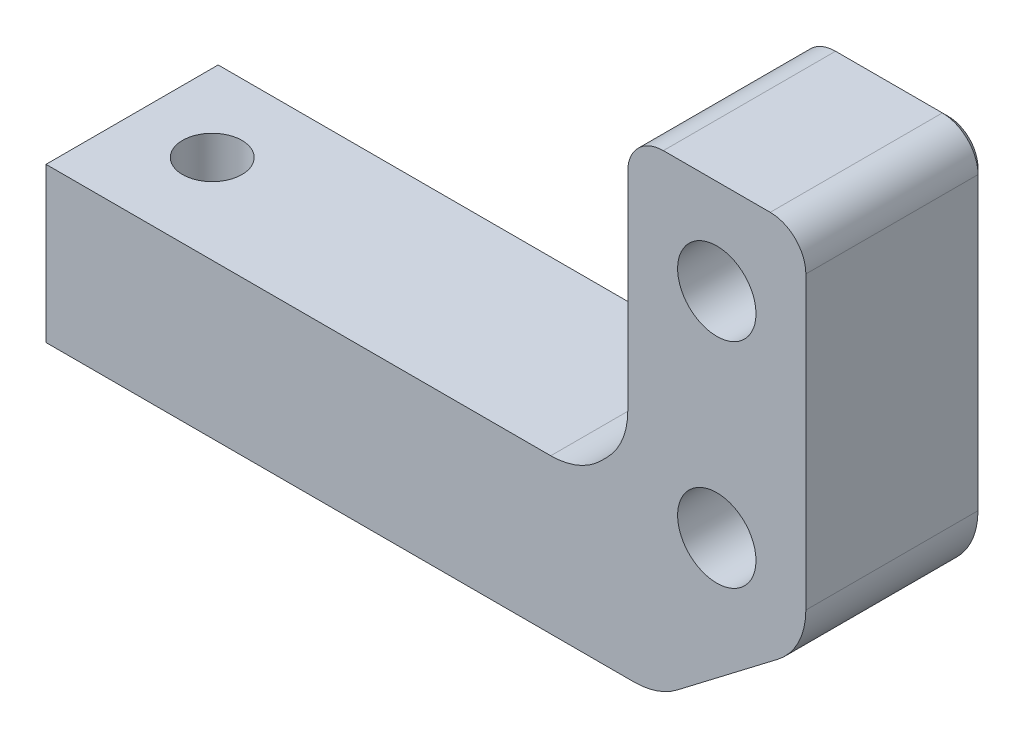
ISO-10303-21;
HEADER;
FILE_DESCRIPTION(('STEP AP214'),'2;1');
FILE_NAME('part.step','',(''),(''),'','','');
FILE_SCHEMA(('AUTOMOTIVE_DESIGN { 1 0 10303 214 1 1 1 1 }'));
ENDSEC;
DATA;
#1=APPLICATION_CONTEXT('core data for automotive mechanical design processes');
#2=APPLICATION_PROTOCOL_DEFINITION('international standard','automotive_design',2000,#1);
#3=PRODUCT_CONTEXT('',#1,'mechanical');
#4=PRODUCT('Part','Part','',(#3));
#5=PRODUCT_RELATED_PRODUCT_CATEGORY('part','',(#4));
#6=PRODUCT_DEFINITION_FORMATION('','',#4);
#7=PRODUCT_DEFINITION_CONTEXT('part definition',#1,'design');
#8=PRODUCT_DEFINITION('design','',#6,#7);
#9=PRODUCT_DEFINITION_SHAPE('','',#8);
#10=(LENGTH_UNIT() NAMED_UNIT(*) SI_UNIT(.MILLI.,.METRE.));
#11=(NAMED_UNIT(*) PLANE_ANGLE_UNIT() SI_UNIT($,.RADIAN.));
#12=(NAMED_UNIT(*) SI_UNIT($,.STERADIAN.) SOLID_ANGLE_UNIT());
#13=UNCERTAINTY_MEASURE_WITH_UNIT(LENGTH_MEASURE(1.E-05),#10,'distance_accuracy_value','');
#14=(GEOMETRIC_REPRESENTATION_CONTEXT(3) GLOBAL_UNCERTAINTY_ASSIGNED_CONTEXT((#13)) GLOBAL_UNIT_ASSIGNED_CONTEXT((#10,
#11,#12)) REPRESENTATION_CONTEXT('',''));
#15=CARTESIAN_POINT('',(0.,0.,0.));
#16=DIRECTION('',(0.,0.,1.));
#17=DIRECTION('',(1.,0.,0.));
#18=AXIS2_PLACEMENT_3D('',#15,#16,#17);
#19=CARTESIAN_POINT('',(19.014718625759,-13.832454105557,30.));
#20=DIRECTION('',(0.,0.,1.));
#21=DIRECTION('',(-1.,0.,0.));
#22=AXIS2_PLACEMENT_3D('',#19,#20,#21);
#23=PLANE('',#22);
#24=DIRECTION('',(0.,-1.,0.));
#25=VECTOR('',#24,1.);
#26=CARTESIAN_POINT('',(-30.4999999999976,-6.83245410555701,30.));
#27=LINE('',#26,#25);
#28=CARTESIAN_POINT('',(-30.4999999999976,-6.83245410555701,30.));
#29=VERTEX_POINT('',#28);
#30=CARTESIAN_POINT('',(-30.4999999999976,-19.832454105557,30.));
#31=VERTEX_POINT('',#30);
#32=EDGE_CURVE('E186',#29,#31,#27,.T.);
#33=ORIENTED_EDGE('',*,*,#32,.T.);
#34=DIRECTION('',(1.,0.,0.));
#35=VECTOR('',#34,1.);
#36=CARTESIAN_POINT('',(-30.4999999999976,-19.832454105557,30.));
#37=LINE('',#36,#35);
#38=CARTESIAN_POINT('',(19.014718625759,-19.832454105557,30.));
#39=VERTEX_POINT('',#38);
#40=EDGE_CURVE('E194',#31,#39,#37,.T.);
#41=ORIENTED_EDGE('',*,*,#40,.T.);
#42=CARTESIAN_POINT('',(19.014718625759,-13.832454105557,30.));
#43=DIRECTION('',(0.,0.,1.));
#44=DIRECTION('',(-1.,0.,0.));
#45=AXIS2_PLACEMENT_3D('',#42,#43,#44);
#46=CIRCLE('',#45,6.00000000000001);
#47=CARTESIAN_POINT('',(22.6581914357032,-18.599539785844,30.));
#48=VERTEX_POINT('',#47);
#49=EDGE_CURVE('E200',#39,#48,#46,.T.);
#50=ORIENTED_EDGE('',*,*,#49,.T.);
#51=DIRECTION('',(0.794514280047827,0.60724546832404,0.));
#52=VECTOR('',#51,1.);
#53=CARTESIAN_POINT('',(22.6581914357032,-18.599539785844,30.));
#54=LINE('',#53,#52);
#55=CARTESIAN_POINT('',(31.1434728099418,-12.1142584116054,30.));
#56=VERTEX_POINT('',#55);
#57=EDGE_CURVE('E215',#48,#56,#54,.T.);
#58=ORIENTED_EDGE('',*,*,#57,.T.);
#59=CARTESIAN_POINT('',(27.4999999999976,-7.34717273131841,30.));
#60=DIRECTION('',(0.,0.,1.));
#61=DIRECTION('',(1.,0.,0.));
#62=AXIS2_PLACEMENT_3D('',#59,#60,#61);
#63=CIRCLE('',#62,6.);
#64=CARTESIAN_POINT('',(33.4999999999976,-7.34717273131841,30.));
#65=VERTEX_POINT('',#64);
#66=EDGE_CURVE('E218',#56,#65,#63,.T.);
#67=ORIENTED_EDGE('',*,*,#66,.T.);
#68=DIRECTION('',(0.,1.,0.));
#69=VECTOR('',#68,1.);
#70=CARTESIAN_POINT('',(33.4999999999976,-7.34717273131841,30.));
#71=LINE('',#70,#69);
#72=CARTESIAN_POINT('',(33.4999999999976,17.167545894443,30.));
#73=VERTEX_POINT('',#72);
#74=EDGE_CURVE('E221',#65,#73,#71,.T.);
#75=ORIENTED_EDGE('',*,*,#74,.T.);
#76=CARTESIAN_POINT('',(30.4999999999976,17.167545894443,30.));
#77=DIRECTION('',(0.,0.,1.));
#78=DIRECTION('',(1.,0.,0.));
#79=AXIS2_PLACEMENT_3D('',#76,#77,#78);
#80=CIRCLE('',#79,3.);
#81=CARTESIAN_POINT('',(30.4999999999976,20.167545894443,30.));
#82=VERTEX_POINT('',#81);
#83=EDGE_CURVE('E224',#73,#82,#80,.T.);
#84=ORIENTED_EDGE('',*,*,#83,.T.);
#85=DIRECTION('',(-1.,0.,0.));
#86=VECTOR('',#85,1.);
#87=CARTESIAN_POINT('',(30.4999999999976,20.167545894443,30.));
#88=LINE('',#87,#86);
#89=CARTESIAN_POINT('',(21.4999999999976,20.167545894443,30.));
#90=VERTEX_POINT('',#89);
#91=EDGE_CURVE('E227',#82,#90,#88,.T.);
#92=ORIENTED_EDGE('',*,*,#91,.T.);
#93=CARTESIAN_POINT('',(21.4999999999976,17.167545894443,30.));
#94=DIRECTION('',(0.,0.,1.));
#95=DIRECTION('',(1.,0.,0.));
#96=AXIS2_PLACEMENT_3D('',#93,#94,#95);
#97=CIRCLE('',#96,3.);
#98=CARTESIAN_POINT('',(18.4999999999976,17.167545894443,30.));
#99=VERTEX_POINT('',#98);
#100=EDGE_CURVE('E230',#90,#99,#97,.T.);
#101=ORIENTED_EDGE('',*,*,#100,.T.);
#102=DIRECTION('',(0.,-1.,0.));
#103=VECTOR('',#102,1.);
#104=CARTESIAN_POINT('',(18.4999999999976,-0.347172731318424,30.));
#105=LINE('',#104,#103);
#106=CARTESIAN_POINT('',(18.4999999999976,-0.347172731318424,30.));
#107=VERTEX_POINT('',#106);
#108=EDGE_CURVE('E233',#99,#107,#105,.T.);
#109=ORIENTED_EDGE('',*,*,#108,.T.);
#110=CARTESIAN_POINT('',(12.4999999999976,-0.347172731318424,30.));
#111=DIRECTION('',(0.,0.,-1.));
#112=DIRECTION('',(1.,0.,0.));
#113=AXIS2_PLACEMENT_3D('',#110,#111,#112);
#114=CIRCLE('',#113,6.);
#115=CARTESIAN_POINT('',(16.7426406871169,-4.58981341843767,30.));
#116=VERTEX_POINT('',#115);
#117=EDGE_CURVE('E236',#107,#116,#114,.T.);
#118=ORIENTED_EDGE('',*,*,#117,.T.);
#119=DIRECTION('',(-0.707106781186538,-0.707106781186557,0.));
#120=VECTOR('',#119,1.);
#121=CARTESIAN_POINT('',(16.2573593128783,-5.07509479267625,30.));
#122=LINE('',#121,#120);
#123=CARTESIAN_POINT('',(16.2573593128783,-5.07509479267625,30.));
#124=VERTEX_POINT('',#123);
#125=EDGE_CURVE('E239',#116,#124,#122,.T.);
#126=ORIENTED_EDGE('',*,*,#125,.T.);
#127=CARTESIAN_POINT('',(12.014718625759,-0.832454105557007,30.));
#128=DIRECTION('',(0.,0.,-1.));
#129=DIRECTION('',(-1.,0.,0.));
#130=AXIS2_PLACEMENT_3D('',#127,#128,#129);
#131=CIRCLE('',#130,6.);
#132=CARTESIAN_POINT('',(12.014718625759,-6.83245410555701,30.));
#133=VERTEX_POINT('',#132);
#134=EDGE_CURVE('E242',#124,#133,#131,.T.);
#135=ORIENTED_EDGE('',*,*,#134,.T.);
#136=DIRECTION('',(-1.,0.,0.));
#137=VECTOR('',#136,1.);
#138=CARTESIAN_POINT('',(-30.4999999999976,-6.83245410555701,30.));
#139=LINE('',#138,#137);
#140=EDGE_CURVE('E206',#133,#29,#139,.T.);
#141=ORIENTED_EDGE('',*,*,#140,.T.);
#142=EDGE_LOOP('',(#33,#41,#50,#58,#67,#75,#84,#92,#101,#109,#118,#126,#135,#141));
#143=FACE_BOUND('',#142,.T.);
#144=CARTESIAN_POINT('',(25.9999999999976,-5.83245410555701,30.));
#145=DIRECTION('',(0.,0.,1.));
#146=DIRECTION('',(1.,0.,0.));
#147=AXIS2_PLACEMENT_3D('',#144,#145,#146);
#148=CIRCLE('',#147,3.3);
#149=CARTESIAN_POINT('',(29.2999999999976,-5.83245410555701,30.));
#150=VERTEX_POINT('',#149);
#151=EDGE_CURVE('E207',#150,#150,#148,.T.);
#152=ORIENTED_EDGE('',*,*,#151,.F.);
#153=EDGE_LOOP('',(#152));
#154=FACE_BOUND('',#153,.T.);
#155=CARTESIAN_POINT('',(25.9999999999976,12.167545894443,30.));
#156=DIRECTION('',(0.,0.,1.));
#157=DIRECTION('',(1.,0.,0.));
#158=AXIS2_PLACEMENT_3D('',#155,#156,#157);
#159=CIRCLE('',#158,3.3);
#160=CARTESIAN_POINT('',(29.2999999999976,12.167545894443,30.));
#161=VERTEX_POINT('',#160);
#162=EDGE_CURVE('E395',#161,#161,#159,.T.);
#163=ORIENTED_EDGE('',*,*,#162,.F.);
#164=EDGE_LOOP('',(#163));
#165=FACE_BOUND('',#164,.T.);
#166=ADVANCED_FACE('F35',(#143,#154,#165),#23,.T.);
#167=CARTESIAN_POINT('',(19.014718625759,-13.832454105557,15.));
#168=DIRECTION('',(0.,0.,1.));
#169=DIRECTION('',(-1.,0.,0.));
#170=AXIS2_PLACEMENT_3D('',#167,#168,#169);
#171=PLANE('',#170);
#172=CARTESIAN_POINT('',(25.9999999999976,12.167545894443,15.));
#173=DIRECTION('',(0.,0.,-1.));
#174=DIRECTION('',(-1.,0.,0.));
#175=AXIS2_PLACEMENT_3D('',#172,#173,#174);
#176=CIRCLE('',#175,6.);
#177=CARTESIAN_POINT('',(19.9999999999976,12.167545894443,15.));
#178=VERTEX_POINT('',#177);
#179=EDGE_CURVE('E315',#178,#178,#176,.T.);
#180=ORIENTED_EDGE('',*,*,#179,.F.);
#181=EDGE_LOOP('',(#180));
#182=FACE_BOUND('',#181,.T.);
#183=CARTESIAN_POINT('',(25.9999999999976,-5.83245410555701,15.));
#184=DIRECTION('',(0.,0.,-1.));
#185=DIRECTION('',(-1.,0.,0.));
#186=AXIS2_PLACEMENT_3D('',#183,#184,#185);
#187=CIRCLE('',#186,5.99999999999999);
#188=CARTESIAN_POINT('',(19.9999999999976,-5.83245410555701,15.));
#189=VERTEX_POINT('',#188);
#190=EDGE_CURVE('E312',#189,#189,#187,.T.);
#191=ORIENTED_EDGE('',*,*,#190,.F.);
#192=EDGE_LOOP('',(#191));
#193=FACE_BOUND('',#192,.T.);
#194=DIRECTION('',(0.,-1.,0.));
#195=VECTOR('',#194,1.);
#196=CARTESIAN_POINT('',(-29.9999999999976,-13.832454105557,15.));
#197=LINE('',#196,#195);
#198=CARTESIAN_POINT('',(-29.9999999999976,-7.33245410555701,15.));
#199=VERTEX_POINT('',#198);
#200=CARTESIAN_POINT('',(-29.9999999999976,-19.332454105557,15.));
#201=VERTEX_POINT('',#200);
#202=EDGE_CURVE('E274',#199,#201,#197,.T.);
#203=ORIENTED_EDGE('',*,*,#202,.F.);
#204=DIRECTION('',(-1.,0.,0.));
#205=VECTOR('',#204,1.);
#206=CARTESIAN_POINT('',(19.014718625759,-7.33245410555701,15.));
#207=LINE('',#206,#205);
#208=CARTESIAN_POINT('',(12.014718625759,-7.33245410555701,15.));
#209=VERTEX_POINT('',#208);
#210=EDGE_CURVE('E272',#209,#199,#207,.T.);
#211=ORIENTED_EDGE('',*,*,#210,.F.);
#212=CARTESIAN_POINT('',(12.014718625759,-0.832454105557007,15.));
#213=DIRECTION('',(0.,0.,-1.));
#214=DIRECTION('',(-1.,0.,0.));
#215=AXIS2_PLACEMENT_3D('',#212,#213,#214);
#216=CIRCLE('',#215,6.5);
#217=CARTESIAN_POINT('',(16.6109127034716,-5.42864818326952,15.));
#218=VERTEX_POINT('',#217);
#219=EDGE_CURVE('E277',#218,#209,#216,.T.);
#220=ORIENTED_EDGE('',*,*,#219,.F.);
#221=DIRECTION('',(-0.707106781186538,-0.707106781186557,0.));
#222=VECTOR('',#221,1.);
#223=CARTESIAN_POINT('',(13.6109127034715,-8.42864818326968,15.));
#224=LINE('',#223,#222);
#225=CARTESIAN_POINT('',(17.0961940777102,-4.94336680903094,15.));
#226=VERTEX_POINT('',#225);
#227=EDGE_CURVE('E279',#226,#218,#224,.T.);
#228=ORIENTED_EDGE('',*,*,#227,.F.);
#229=CARTESIAN_POINT('',(12.4999999999976,-0.347172731318424,15.));
#230=DIRECTION('',(0.,0.,-1.));
#231=DIRECTION('',(-1.,0.,0.));
#232=AXIS2_PLACEMENT_3D('',#229,#230,#231);
#233=CIRCLE('',#232,6.5);
#234=CARTESIAN_POINT('',(18.9999999999976,-0.347172731318424,15.));
#235=VERTEX_POINT('',#234);
#236=EDGE_CURVE('E282',#235,#226,#233,.T.);
#237=ORIENTED_EDGE('',*,*,#236,.F.);
#238=DIRECTION('',(0.,-1.,0.));
#239=VECTOR('',#238,1.);
#240=CARTESIAN_POINT('',(18.9999999999976,-13.832454105557,15.));
#241=LINE('',#240,#239);
#242=CARTESIAN_POINT('',(18.9999999999976,17.167545894443,15.));
#243=VERTEX_POINT('',#242);
#244=EDGE_CURVE('E285',#243,#235,#241,.T.);
#245=ORIENTED_EDGE('',*,*,#244,.F.);
#246=CARTESIAN_POINT('',(21.4999999999976,17.167545894443,15.));
#247=DIRECTION('',(0.,0.,-1.));
#248=DIRECTION('',(-1.,0.,0.));
#249=AXIS2_PLACEMENT_3D('',#246,#247,#248);
#250=CIRCLE('',#249,2.5);
#251=CARTESIAN_POINT('',(21.4999999999976,19.667545894443,15.));
#252=VERTEX_POINT('',#251);
#253=EDGE_CURVE('E288',#252,#243,#250,.F.);
#254=ORIENTED_EDGE('',*,*,#253,.F.);
#255=DIRECTION('',(-1.,0.,0.));
#256=VECTOR('',#255,1.);
#257=CARTESIAN_POINT('',(19.014718625759,19.667545894443,15.));
#258=LINE('',#257,#256);
#259=CARTESIAN_POINT('',(30.4999999999976,19.667545894443,15.));
#260=VERTEX_POINT('',#259);
#261=EDGE_CURVE('E291',#260,#252,#258,.T.);
#262=ORIENTED_EDGE('',*,*,#261,.F.);
#263=CARTESIAN_POINT('',(30.4999999999976,17.167545894443,15.));
#264=DIRECTION('',(0.,0.,-1.));
#265=DIRECTION('',(-1.,0.,0.));
#266=AXIS2_PLACEMENT_3D('',#263,#264,#265);
#267=CIRCLE('',#266,2.5);
#268=CARTESIAN_POINT('',(32.9999999999976,17.167545894443,15.));
#269=VERTEX_POINT('',#268);
#270=EDGE_CURVE('E294',#269,#260,#267,.F.);
#271=ORIENTED_EDGE('',*,*,#270,.F.);
#272=DIRECTION('',(0.,1.,0.));
#273=VECTOR('',#272,1.);
#274=CARTESIAN_POINT('',(32.9999999999976,-13.832454105557,15.));
#275=LINE('',#274,#273);
#276=CARTESIAN_POINT('',(32.9999999999976,-7.34717273131841,15.));
#277=VERTEX_POINT('',#276);
#278=EDGE_CURVE('E297',#277,#269,#275,.T.);
#279=ORIENTED_EDGE('',*,*,#278,.F.);
#280=CARTESIAN_POINT('',(27.4999999999976,-7.34717273131841,15.));
#281=DIRECTION('',(0.,0.,-1.));
#282=DIRECTION('',(-1.,0.,0.));
#283=AXIS2_PLACEMENT_3D('',#280,#281,#282);
#284=CIRCLE('',#283,5.5);
#285=CARTESIAN_POINT('',(30.8398500757798,-11.7170012715815,15.));
#286=VERTEX_POINT('',#285);
#287=EDGE_CURVE('E300',#286,#277,#284,.F.);
#288=ORIENTED_EDGE('',*,*,#287,.F.);
#289=DIRECTION('',(0.794514280047827,0.60724546832404,0.));
#290=VECTOR('',#289,1.);
#291=CARTESIAN_POINT('',(22.3545687015412,-18.2022826458201,15.));
#292=LINE('',#291,#290);
#293=CARTESIAN_POINT('',(22.3545687015412,-18.2022826458201,15.));
#294=VERTEX_POINT('',#293);
#295=EDGE_CURVE('E303',#294,#286,#292,.T.);
#296=ORIENTED_EDGE('',*,*,#295,.F.);
#297=CARTESIAN_POINT('',(19.014718625759,-13.832454105557,15.));
#298=DIRECTION('',(0.,0.,-1.));
#299=DIRECTION('',(-1.,0.,0.));
#300=AXIS2_PLACEMENT_3D('',#297,#298,#299);
#301=CIRCLE('',#300,5.50000000000001);
#302=CARTESIAN_POINT('',(19.014718625759,-19.332454105557,15.));
#303=VERTEX_POINT('',#302);
#304=EDGE_CURVE('E306',#303,#294,#301,.F.);
#305=ORIENTED_EDGE('',*,*,#304,.F.);
#306=DIRECTION('',(1.,0.,0.));
#307=VECTOR('',#306,1.);
#308=CARTESIAN_POINT('',(19.014718625759,-19.332454105557,15.));
#309=LINE('',#308,#307);
#310=EDGE_CURVE('E309',#201,#303,#309,.T.);
#311=ORIENTED_EDGE('',*,*,#310,.F.);
#312=EDGE_LOOP('',(#203,#211,#220,#228,#237,#245,#254,#262,#271,#279,#288,#296,#305,#311));
#313=FACE_BOUND('',#312,.T.);
#314=ADVANCED_FACE('F421',(#182,#193,#313),#171,.F.);
#315=CARTESIAN_POINT('',(-30.4999999999976,-6.83245410555701,15.));
#316=DIRECTION('',(1.,0.,0.));
#317=DIRECTION('',(0.,0.,1.));
#318=AXIS2_PLACEMENT_3D('',#315,#316,#317);
#319=PLANE('',#318);
#320=DIRECTION('',(0.,0.,1.));
#321=VECTOR('',#320,1.);
#322=CARTESIAN_POINT('',(-30.4999999999976,-19.832454105557,15.));
#323=LINE('',#322,#321);
#324=CARTESIAN_POINT('',(-30.4999999999976,-19.832454105557,15.5));
#325=VERTEX_POINT('',#324);
#326=EDGE_CURVE('E181',#325,#31,#323,.T.);
#327=ORIENTED_EDGE('',*,*,#326,.T.);
#328=ORIENTED_EDGE('',*,*,#32,.F.);
#329=DIRECTION('',(0.,0.,1.));
#330=VECTOR('',#329,1.);
#331=CARTESIAN_POINT('',(-30.4999999999976,-6.83245410555701,15.));
#332=LINE('',#331,#330);
#333=CARTESIAN_POINT('',(-30.4999999999976,-6.83245410555701,15.5));
#334=VERTEX_POINT('',#333);
#335=EDGE_CURVE('E245',#334,#29,#332,.T.);
#336=ORIENTED_EDGE('',*,*,#335,.F.);
#337=DIRECTION('',(0.,1.,0.));
#338=VECTOR('',#337,1.);
#339=CARTESIAN_POINT('',(-30.4999999999976,-6.83245410555701,15.5));
#340=LINE('',#339,#338);
#341=EDGE_CURVE('E44',#325,#334,#340,.T.);
#342=ORIENTED_EDGE('',*,*,#341,.F.);
#343=EDGE_LOOP('',(#327,#328,#336,#342));
#344=FACE_BOUND('',#343,.T.);
#345=ADVANCED_FACE('F183',(#344),#319,.F.);
#346=CARTESIAN_POINT('',(-30.4999999999976,-19.832454105557,15.));
#347=DIRECTION('',(0.,1.,0.));
#348=DIRECTION('',(0.,0.,-1.));
#349=AXIS2_PLACEMENT_3D('',#346,#347,#348);
#350=PLANE('',#349);
#351=CARTESIAN_POINT('',(-23.9999999999976,-19.832454105557,22.5));
#352=DIRECTION('',(0.,-1.,0.));
#353=DIRECTION('',(0.,0.,-1.));
#354=AXIS2_PLACEMENT_3D('',#351,#352,#353);
#355=CIRCLE('',#354,2.5);
#356=CARTESIAN_POINT('',(-23.9999999999976,-19.832454105557,20.));
#357=VERTEX_POINT('',#356);
#358=EDGE_CURVE('E382',#357,#357,#355,.T.);
#359=ORIENTED_EDGE('',*,*,#358,.F.);
#360=EDGE_LOOP('',(#359));
#361=FACE_BOUND('',#360,.T.);
#362=DIRECTION('',(0.,0.,1.));
#363=VECTOR('',#362,1.);
#364=CARTESIAN_POINT('',(19.014718625759,-19.832454105557,15.));
#365=LINE('',#364,#363);
#366=CARTESIAN_POINT('',(19.014718625759,-19.832454105557,15.5));
#367=VERTEX_POINT('',#366);
#368=EDGE_CURVE('E191',#367,#39,#365,.T.);
#369=ORIENTED_EDGE('',*,*,#368,.T.);
#370=ORIENTED_EDGE('',*,*,#40,.F.);
#371=ORIENTED_EDGE('',*,*,#326,.F.);
#372=DIRECTION('',(-1.,0.,0.));
#373=VECTOR('',#372,1.);
#374=CARTESIAN_POINT('',(-30.4999999999976,-19.832454105557,15.5));
#375=LINE('',#374,#373);
#376=EDGE_CURVE('E321',#367,#325,#375,.T.);
#377=ORIENTED_EDGE('',*,*,#376,.F.);
#378=EDGE_LOOP('',(#369,#370,#371,#377));
#379=FACE_BOUND('',#378,.T.);
#380=ADVANCED_FACE('F195',(#361,#379),#350,.F.);
#381=CARTESIAN_POINT('',(19.014718625759,-13.832454105557,15.));
#382=DIRECTION('',(0.,0.,1.));
#383=DIRECTION('',(-1.,0.,0.));
#384=AXIS2_PLACEMENT_3D('',#381,#382,#383);
#385=CYLINDRICAL_SURFACE('',#384,6.00000000000001);
#386=DIRECTION('',(0.,0.,1.));
#387=VECTOR('',#386,1.);
#388=CARTESIAN_POINT('',(22.6581914357032,-18.599539785844,15.));
#389=LINE('',#388,#387);
#390=CARTESIAN_POINT('',(22.6581914357032,-18.599539785844,15.5));
#391=VERTEX_POINT('',#390);
#392=EDGE_CURVE('E267',#391,#48,#389,.T.);
#393=ORIENTED_EDGE('',*,*,#392,.T.);
#394=ORIENTED_EDGE('',*,*,#49,.F.);
#395=ORIENTED_EDGE('',*,*,#368,.F.);
#396=CARTESIAN_POINT('',(19.014718625759,-13.832454105557,15.5));
#397=DIRECTION('',(0.,0.,-1.));
#398=DIRECTION('',(-1.,0.,0.));
#399=AXIS2_PLACEMENT_3D('',#396,#397,#398);
#400=CIRCLE('',#399,6.00000000000001);
#401=EDGE_CURVE('E324',#391,#367,#400,.T.);
#402=ORIENTED_EDGE('',*,*,#401,.F.);
#403=EDGE_LOOP('',(#393,#394,#395,#402));
#404=FACE_BOUND('',#403,.T.);
#405=ADVANCED_FACE('F466',(#404),#385,.T.);
#406=CARTESIAN_POINT('',(22.6581914357032,-18.599539785844,15.));
#407=DIRECTION('',(-0.60724546832404,0.794514280047827,0.));
#408=DIRECTION('',(-0.794514280047828,-0.60724546832404,0.));
#409=AXIS2_PLACEMENT_3D('',#406,#407,#408);
#410=PLANE('',#409);
#411=DIRECTION('',(0.,0.,1.));
#412=VECTOR('',#411,1.);
#413=CARTESIAN_POINT('',(31.1434728099418,-12.1142584116054,15.));
#414=LINE('',#413,#412);
#415=CARTESIAN_POINT('',(31.1434728099418,-12.1142584116054,15.5));
#416=VERTEX_POINT('',#415);
#417=EDGE_CURVE('E265',#416,#56,#414,.T.);
#418=ORIENTED_EDGE('',*,*,#417,.T.);
#419=ORIENTED_EDGE('',*,*,#57,.F.);
#420=ORIENTED_EDGE('',*,*,#392,.F.);
#421=DIRECTION('',(-0.794514280047828,-0.60724546832404,0.));
#422=VECTOR('',#421,1.);
#423=CARTESIAN_POINT('',(22.6581914357032,-18.599539785844,15.5));
#424=LINE('',#423,#422);
#425=EDGE_CURVE('E327',#416,#391,#424,.T.);
#426=ORIENTED_EDGE('',*,*,#425,.F.);
#427=EDGE_LOOP('',(#418,#419,#420,#426));
#428=FACE_BOUND('',#427,.T.);
#429=ADVANCED_FACE('F462',(#428),#410,.F.);
#430=CARTESIAN_POINT('',(27.4999999999976,-7.34717273131841,15.));
#431=DIRECTION('',(0.,0.,1.));
#432=DIRECTION('',(-1.,0.,0.));
#433=AXIS2_PLACEMENT_3D('',#430,#431,#432);
#434=CYLINDRICAL_SURFACE('',#433,6.);
#435=DIRECTION('',(0.,0.,1.));
#436=VECTOR('',#435,1.);
#437=CARTESIAN_POINT('',(33.4999999999976,-7.34717273131841,15.));
#438=LINE('',#437,#436);
#439=CARTESIAN_POINT('',(33.4999999999976,-7.34717273131841,15.5));
#440=VERTEX_POINT('',#439);
#441=EDGE_CURVE('E263',#440,#65,#438,.T.);
#442=ORIENTED_EDGE('',*,*,#441,.T.);
#443=ORIENTED_EDGE('',*,*,#66,.F.);
#444=ORIENTED_EDGE('',*,*,#417,.F.);
#445=CARTESIAN_POINT('',(27.4999999999976,-7.34717273131841,15.5));
#446=DIRECTION('',(0.,0.,-1.));
#447=DIRECTION('',(-1.,0.,0.));
#448=AXIS2_PLACEMENT_3D('',#445,#446,#447);
#449=CIRCLE('',#448,6.);
#450=EDGE_CURVE('E330',#440,#416,#449,.T.);
#451=ORIENTED_EDGE('',*,*,#450,.F.);
#452=EDGE_LOOP('',(#442,#443,#444,#451));
#453=FACE_BOUND('',#452,.T.);
#454=ADVANCED_FACE('F458',(#453),#434,.T.);
#455=CARTESIAN_POINT('',(33.4999999999976,-7.34717273131841,15.));
#456=DIRECTION('',(-1.,0.,0.));
#457=DIRECTION('',(0.,0.,-1.));
#458=AXIS2_PLACEMENT_3D('',#455,#456,#457);
#459=PLANE('',#458);
#460=DIRECTION('',(0.,0.,1.));
#461=VECTOR('',#460,1.);
#462=CARTESIAN_POINT('',(33.4999999999976,17.167545894443,15.));
#463=LINE('',#462,#461);
#464=CARTESIAN_POINT('',(33.4999999999976,17.167545894443,15.5));
#465=VERTEX_POINT('',#464);
#466=EDGE_CURVE('E261',#465,#73,#463,.T.);
#467=ORIENTED_EDGE('',*,*,#466,.T.);
#468=ORIENTED_EDGE('',*,*,#74,.F.);
#469=ORIENTED_EDGE('',*,*,#441,.F.);
#470=DIRECTION('',(0.,-1.,0.));
#471=VECTOR('',#470,1.);
#472=CARTESIAN_POINT('',(33.4999999999976,-7.34717273131841,15.5));
#473=LINE('',#472,#471);
#474=EDGE_CURVE('E333',#465,#440,#473,.T.);
#475=ORIENTED_EDGE('',*,*,#474,.F.);
#476=EDGE_LOOP('',(#467,#468,#469,#475));
#477=FACE_BOUND('',#476,.T.);
#478=ADVANCED_FACE('F454',(#477),#459,.F.);
#479=CARTESIAN_POINT('',(30.4999999999976,17.167545894443,15.));
#480=DIRECTION('',(0.,0.,1.));
#481=DIRECTION('',(-1.,0.,0.));
#482=AXIS2_PLACEMENT_3D('',#479,#480,#481);
#483=CYLINDRICAL_SURFACE('',#482,3.);
#484=DIRECTION('',(0.,0.,1.));
#485=VECTOR('',#484,1.);
#486=CARTESIAN_POINT('',(30.4999999999976,20.167545894443,15.));
#487=LINE('',#486,#485);
#488=CARTESIAN_POINT('',(30.4999999999976,20.167545894443,15.5));
#489=VERTEX_POINT('',#488);
#490=EDGE_CURVE('E259',#489,#82,#487,.T.);
#491=ORIENTED_EDGE('',*,*,#490,.T.);
#492=ORIENTED_EDGE('',*,*,#83,.F.);
#493=ORIENTED_EDGE('',*,*,#466,.F.);
#494=CARTESIAN_POINT('',(30.4999999999976,17.167545894443,15.5));
#495=DIRECTION('',(0.,0.,-1.));
#496=DIRECTION('',(-1.,0.,0.));
#497=AXIS2_PLACEMENT_3D('',#494,#495,#496);
#498=CIRCLE('',#497,3.);
#499=EDGE_CURVE('E336',#489,#465,#498,.T.);
#500=ORIENTED_EDGE('',*,*,#499,.F.);
#501=EDGE_LOOP('',(#491,#492,#493,#500));
#502=FACE_BOUND('',#501,.T.);
#503=ADVANCED_FACE('F450',(#502),#483,.T.);
#504=CARTESIAN_POINT('',(30.4999999999976,20.167545894443,15.));
#505=DIRECTION('',(0.,-1.,0.));
#506=DIRECTION('',(0.,0.,1.));
#507=AXIS2_PLACEMENT_3D('',#504,#505,#506);
#508=PLANE('',#507);
#509=DIRECTION('',(0.,0.,1.));
#510=VECTOR('',#509,1.);
#511=CARTESIAN_POINT('',(21.4999999999976,20.167545894443,15.));
#512=LINE('',#511,#510);
#513=CARTESIAN_POINT('',(21.4999999999976,20.167545894443,15.5));
#514=VERTEX_POINT('',#513);
#515=EDGE_CURVE('E257',#514,#90,#512,.T.);
#516=ORIENTED_EDGE('',*,*,#515,.T.);
#517=ORIENTED_EDGE('',*,*,#91,.F.);
#518=ORIENTED_EDGE('',*,*,#490,.F.);
#519=DIRECTION('',(1.,0.,0.));
#520=VECTOR('',#519,1.);
#521=CARTESIAN_POINT('',(30.4999999999976,20.167545894443,15.5));
#522=LINE('',#521,#520);
#523=EDGE_CURVE('E339',#514,#489,#522,.T.);
#524=ORIENTED_EDGE('',*,*,#523,.F.);
#525=EDGE_LOOP('',(#516,#517,#518,#524));
#526=FACE_BOUND('',#525,.T.);
#527=ADVANCED_FACE('F446',(#526),#508,.F.);
#528=CARTESIAN_POINT('',(21.4999999999976,17.167545894443,15.));
#529=DIRECTION('',(0.,0.,1.));
#530=DIRECTION('',(-1.,0.,0.));
#531=AXIS2_PLACEMENT_3D('',#528,#529,#530);
#532=CYLINDRICAL_SURFACE('',#531,3.);
#533=DIRECTION('',(0.,0.,1.));
#534=VECTOR('',#533,1.);
#535=CARTESIAN_POINT('',(18.4999999999976,17.167545894443,15.));
#536=LINE('',#535,#534);
#537=CARTESIAN_POINT('',(18.4999999999976,17.167545894443,15.5));
#538=VERTEX_POINT('',#537);
#539=EDGE_CURVE('E255',#538,#99,#536,.T.);
#540=ORIENTED_EDGE('',*,*,#539,.T.);
#541=ORIENTED_EDGE('',*,*,#100,.F.);
#542=ORIENTED_EDGE('',*,*,#515,.F.);
#543=CARTESIAN_POINT('',(21.4999999999976,17.167545894443,15.5));
#544=DIRECTION('',(0.,0.,-1.));
#545=DIRECTION('',(-1.,0.,0.));
#546=AXIS2_PLACEMENT_3D('',#543,#544,#545);
#547=CIRCLE('',#546,3.);
#548=EDGE_CURVE('E342',#538,#514,#547,.T.);
#549=ORIENTED_EDGE('',*,*,#548,.F.);
#550=EDGE_LOOP('',(#540,#541,#542,#549));
#551=FACE_BOUND('',#550,.T.);
#552=ADVANCED_FACE('F442',(#551),#532,.T.);
#553=CARTESIAN_POINT('',(18.4999999999976,-0.347172731318424,15.));
#554=DIRECTION('',(1.,0.,0.));
#555=DIRECTION('',(0.,1.,0.));
#556=AXIS2_PLACEMENT_3D('',#553,#554,#555);
#557=PLANE('',#556);
#558=DIRECTION('',(0.,0.,1.));
#559=VECTOR('',#558,1.);
#560=CARTESIAN_POINT('',(18.4999999999976,-0.347172731318424,15.));
#561=LINE('',#560,#559);
#562=CARTESIAN_POINT('',(18.4999999999976,-0.347172731318424,15.5));
#563=VERTEX_POINT('',#562);
#564=EDGE_CURVE('E253',#563,#107,#561,.T.);
#565=ORIENTED_EDGE('',*,*,#564,.T.);
#566=ORIENTED_EDGE('',*,*,#108,.F.);
#567=ORIENTED_EDGE('',*,*,#539,.F.);
#568=DIRECTION('',(0.,1.,0.));
#569=VECTOR('',#568,1.);
#570=CARTESIAN_POINT('',(18.4999999999976,-0.347172731318424,15.5));
#571=LINE('',#570,#569);
#572=EDGE_CURVE('E345',#563,#538,#571,.T.);
#573=ORIENTED_EDGE('',*,*,#572,.F.);
#574=EDGE_LOOP('',(#565,#566,#567,#573));
#575=FACE_BOUND('',#574,.T.);
#576=ADVANCED_FACE('F438',(#575),#557,.F.);
#577=CARTESIAN_POINT('',(12.4999999999976,-0.347172731318424,15.));
#578=DIRECTION('',(0.,0.,1.));
#579=DIRECTION('',(-1.,0.,0.));
#580=AXIS2_PLACEMENT_3D('',#577,#578,#579);
#581=CYLINDRICAL_SURFACE('',#580,6.);
#582=DIRECTION('',(0.,0.,1.));
#583=VECTOR('',#582,1.);
#584=CARTESIAN_POINT('',(16.7426406871169,-4.58981341843767,15.));
#585=LINE('',#584,#583);
#586=CARTESIAN_POINT('',(16.7426406871169,-4.58981341843767,15.5));
#587=VERTEX_POINT('',#586);
#588=EDGE_CURVE('E251',#587,#116,#585,.T.);
#589=ORIENTED_EDGE('',*,*,#588,.T.);
#590=ORIENTED_EDGE('',*,*,#117,.F.);
#591=ORIENTED_EDGE('',*,*,#564,.F.);
#592=CARTESIAN_POINT('',(12.4999999999976,-0.347172731318424,15.5));
#593=DIRECTION('',(0.,0.,-1.));
#594=DIRECTION('',(-1.,0.,0.));
#595=AXIS2_PLACEMENT_3D('',#592,#593,#594);
#596=CIRCLE('',#595,6.);
#597=EDGE_CURVE('E348',#587,#563,#596,.F.);
#598=ORIENTED_EDGE('',*,*,#597,.F.);
#599=EDGE_LOOP('',(#589,#590,#591,#598));
#600=FACE_BOUND('',#599,.T.);
#601=ADVANCED_FACE('F434',(#600),#581,.F.);
#602=CARTESIAN_POINT('',(16.2573593128783,-5.07509479267625,15.));
#603=DIRECTION('',(0.707106781186557,-0.707106781186538,0.));
#604=DIRECTION('',(0.707106781186538,0.707106781186557,0.));
#605=AXIS2_PLACEMENT_3D('',#602,#603,#604);
#606=PLANE('',#605);
#607=DIRECTION('',(0.,0.,1.));
#608=VECTOR('',#607,1.);
#609=CARTESIAN_POINT('',(16.2573593128783,-5.07509479267625,15.));
#610=LINE('',#609,#608);
#611=CARTESIAN_POINT('',(16.2573593128783,-5.07509479267625,15.5));
#612=VERTEX_POINT('',#611);
#613=EDGE_CURVE('E249',#612,#124,#610,.T.);
#614=ORIENTED_EDGE('',*,*,#613,.T.);
#615=ORIENTED_EDGE('',*,*,#125,.F.);
#616=ORIENTED_EDGE('',*,*,#588,.F.);
#617=DIRECTION('',(0.707106781186538,0.707106781186557,0.));
#618=VECTOR('',#617,1.);
#619=CARTESIAN_POINT('',(16.2573593128783,-5.07509479267625,15.5));
#620=LINE('',#619,#618);
#621=EDGE_CURVE('E351',#612,#587,#620,.T.);
#622=ORIENTED_EDGE('',*,*,#621,.F.);
#623=EDGE_LOOP('',(#614,#615,#616,#622));
#624=FACE_BOUND('',#623,.T.);
#625=ADVANCED_FACE('F430',(#624),#606,.F.);
#626=CARTESIAN_POINT('',(12.014718625759,-0.832454105557007,15.));
#627=DIRECTION('',(0.,0.,1.));
#628=DIRECTION('',(-1.,0.,0.));
#629=AXIS2_PLACEMENT_3D('',#626,#627,#628);
#630=CYLINDRICAL_SURFACE('',#629,6.);
#631=DIRECTION('',(0.,0.,1.));
#632=VECTOR('',#631,1.);
#633=CARTESIAN_POINT('',(12.014718625759,-6.83245410555701,15.));
#634=LINE('',#633,#632);
#635=CARTESIAN_POINT('',(12.014718625759,-6.83245410555701,15.5));
#636=VERTEX_POINT('',#635);
#637=EDGE_CURVE('E247',#636,#133,#634,.T.);
#638=ORIENTED_EDGE('',*,*,#637,.T.);
#639=ORIENTED_EDGE('',*,*,#134,.F.);
#640=ORIENTED_EDGE('',*,*,#613,.F.);
#641=CARTESIAN_POINT('',(12.014718625759,-0.832454105557007,15.5));
#642=DIRECTION('',(0.,0.,-1.));
#643=DIRECTION('',(-1.,0.,0.));
#644=AXIS2_PLACEMENT_3D('',#641,#642,#643);
#645=CIRCLE('',#644,6.);
#646=EDGE_CURVE('E354',#636,#612,#645,.F.);
#647=ORIENTED_EDGE('',*,*,#646,.F.);
#648=EDGE_LOOP('',(#638,#639,#640,#647));
#649=FACE_BOUND('',#648,.T.);
#650=ADVANCED_FACE('F417',(#649),#630,.F.);
#651=CARTESIAN_POINT('',(-30.4999999999976,-6.83245410555701,15.));
#652=DIRECTION('',(0.,-1.,0.));
#653=DIRECTION('',(0.,0.,1.));
#654=AXIS2_PLACEMENT_3D('',#651,#652,#653);
#655=PLANE('',#654);
#656=CARTESIAN_POINT('',(-23.9999999999976,-6.83245410555701,22.5));
#657=DIRECTION('',(0.,-1.,0.));
#658=DIRECTION('',(0.,0.,-1.));
#659=AXIS2_PLACEMENT_3D('',#656,#657,#658);
#660=CIRCLE('',#659,2.5);
#661=CARTESIAN_POINT('',(-23.9999999999976,-6.83245410555701,20.));
#662=VERTEX_POINT('',#661);
#663=EDGE_CURVE('E380',#662,#662,#660,.T.);
#664=ORIENTED_EDGE('',*,*,#663,.T.);
#665=EDGE_LOOP('',(#664));
#666=FACE_BOUND('',#665,.T.);
#667=ORIENTED_EDGE('',*,*,#335,.T.);
#668=ORIENTED_EDGE('',*,*,#140,.F.);
#669=ORIENTED_EDGE('',*,*,#637,.F.);
#670=DIRECTION('',(1.,0.,0.));
#671=VECTOR('',#670,1.);
#672=CARTESIAN_POINT('',(-30.4999999999976,-6.83245410555701,15.5));
#673=LINE('',#672,#671);
#674=EDGE_CURVE('E11',#334,#636,#673,.T.);
#675=ORIENTED_EDGE('',*,*,#674,.F.);
#676=EDGE_LOOP('',(#667,#668,#669,#675));
#677=FACE_BOUND('',#676,.T.);
#678=ADVANCED_FACE('F408',(#666,#677),#655,.F.);
#679=CARTESIAN_POINT('',(25.9999999999976,-5.83245410555701,15.));
#680=DIRECTION('',(0.,0.,-1.));
#681=DIRECTION('',(1.,0.,0.));
#682=AXIS2_PLACEMENT_3D('',#679,#680,#681);
#683=CYLINDRICAL_SURFACE('',#682,3.3);
#684=ORIENTED_EDGE('',*,*,#151,.T.);
#685=EDGE_LOOP('',(#684));
#686=FACE_BOUND('',#685,.T.);
#687=CARTESIAN_POINT('',(25.9999999999976,-5.83245410555701,21.4));
#688=DIRECTION('',(0.,0.,1.));
#689=DIRECTION('',(1.,0.,0.));
#690=AXIS2_PLACEMENT_3D('',#687,#688,#689);
#691=CIRCLE('',#690,3.3);
#692=CARTESIAN_POINT('',(29.2999999999976,-5.83245410555701,21.4));
#693=VERTEX_POINT('',#692);
#694=EDGE_CURVE('E210',#693,#693,#691,.T.);
#695=ORIENTED_EDGE('',*,*,#694,.F.);
#696=EDGE_LOOP('',(#695));
#697=FACE_BOUND('',#696,.T.);
#698=ADVANCED_FACE('F406',(#686,#697),#683,.F.);
#699=CARTESIAN_POINT('',(29.2999999999976,-5.83245410555701,21.4));
#700=DIRECTION('',(0.,0.,1.));
#701=DIRECTION('',(-1.,0.,0.));
#702=AXIS2_PLACEMENT_3D('',#699,#700,#701);
#703=PLANE('',#702);
#704=ORIENTED_EDGE('',*,*,#694,.T.);
#705=EDGE_LOOP('',(#704));
#706=FACE_BOUND('',#705,.T.);
#707=CARTESIAN_POINT('',(25.9999999999976,-5.83245410555701,21.4));
#708=DIRECTION('',(0.,0.,1.));
#709=DIRECTION('',(1.,0.,0.));
#710=AXIS2_PLACEMENT_3D('',#707,#708,#709);
#711=CIRCLE('',#710,5.5);
#712=CARTESIAN_POINT('',(31.4999999999976,-5.83245410555701,21.4));
#713=VERTEX_POINT('',#712);
#714=EDGE_CURVE('E398',#713,#713,#711,.T.);
#715=ORIENTED_EDGE('',*,*,#714,.F.);
#716=EDGE_LOOP('',(#715));
#717=FACE_BOUND('',#716,.T.);
#718=ADVANCED_FACE('F403',(#706,#717),#703,.F.);
#719=CARTESIAN_POINT('',(25.9999999999976,-5.83245410555701,15.));
#720=DIRECTION('',(0.,0.,-1.));
#721=DIRECTION('',(1.,0.,0.));
#722=AXIS2_PLACEMENT_3D('',#719,#720,#721);
#723=CYLINDRICAL_SURFACE('',#722,5.5);
#724=CARTESIAN_POINT('',(25.9999999999976,-5.83245410555701,15.5));
#725=DIRECTION('',(0.,0.,-1.));
#726=DIRECTION('',(-1.,0.,0.));
#727=AXIS2_PLACEMENT_3D('',#724,#725,#726);
#728=CIRCLE('',#727,5.5);
#729=CARTESIAN_POINT('',(20.4999999999976,-5.83245410555701,15.5));
#730=VERTEX_POINT('',#729);
#731=EDGE_CURVE('E318',#730,#730,#728,.F.);
#732=ORIENTED_EDGE('',*,*,#731,.F.);
#733=EDGE_LOOP('',(#732));
#734=FACE_BOUND('',#733,.T.);
#735=ORIENTED_EDGE('',*,*,#714,.T.);
#736=EDGE_LOOP('',(#735));
#737=FACE_BOUND('',#736,.T.);
#738=ADVANCED_FACE('F415',(#734,#737),#723,.F.);
#739=CARTESIAN_POINT('',(25.9999999999976,12.167545894443,15.));
#740=DIRECTION('',(0.,0.,-1.));
#741=DIRECTION('',(1.,0.,0.));
#742=AXIS2_PLACEMENT_3D('',#739,#740,#741);
#743=CYLINDRICAL_SURFACE('',#742,3.3);
#744=ORIENTED_EDGE('',*,*,#162,.T.);
#745=EDGE_LOOP('',(#744));
#746=FACE_BOUND('',#745,.T.);
#747=CARTESIAN_POINT('',(25.9999999999976,12.167545894443,21.4));
#748=DIRECTION('',(0.,0.,1.));
#749=DIRECTION('',(1.,0.,0.));
#750=AXIS2_PLACEMENT_3D('',#747,#748,#749);
#751=CIRCLE('',#750,3.3);
#752=CARTESIAN_POINT('',(29.2999999999976,12.167545894443,21.4));
#753=VERTEX_POINT('',#752);
#754=EDGE_CURVE('E392',#753,#753,#751,.T.);
#755=ORIENTED_EDGE('',*,*,#754,.F.);
#756=EDGE_LOOP('',(#755));
#757=FACE_BOUND('',#756,.T.);
#758=ADVANCED_FACE('F616',(#746,#757),#743,.F.);
#759=CARTESIAN_POINT('',(29.2999999999976,12.167545894443,21.4));
#760=DIRECTION('',(0.,0.,1.));
#761=DIRECTION('',(-1.,0.,0.));
#762=AXIS2_PLACEMENT_3D('',#759,#760,#761);
#763=PLANE('',#762);
#764=ORIENTED_EDGE('',*,*,#754,.T.);
#765=EDGE_LOOP('',(#764));
#766=FACE_BOUND('',#765,.T.);
#767=CARTESIAN_POINT('',(25.9999999999976,12.167545894443,21.4));
#768=DIRECTION('',(0.,0.,1.));
#769=DIRECTION('',(1.,0.,0.));
#770=AXIS2_PLACEMENT_3D('',#767,#768,#769);
#771=CIRCLE('',#770,5.5);
#772=CARTESIAN_POINT('',(31.4999999999976,12.167545894443,21.4));
#773=VERTEX_POINT('',#772);
#774=EDGE_CURVE('E387',#773,#773,#771,.T.);
#775=ORIENTED_EDGE('',*,*,#774,.F.);
#776=EDGE_LOOP('',(#775));
#777=FACE_BOUND('',#776,.T.);
#778=ADVANCED_FACE('F608',(#766,#777),#763,.F.);
#779=CARTESIAN_POINT('',(25.9999999999976,12.167545894443,15.));
#780=DIRECTION('',(0.,0.,-1.));
#781=DIRECTION('',(1.,0.,0.));
#782=AXIS2_PLACEMENT_3D('',#779,#780,#781);
#783=CYLINDRICAL_SURFACE('',#782,5.5);
#784=CARTESIAN_POINT('',(25.9999999999976,12.167545894443,15.5));
#785=DIRECTION('',(0.,0.,-1.));
#786=DIRECTION('',(-1.,0.,0.));
#787=AXIS2_PLACEMENT_3D('',#784,#785,#786);
#788=CIRCLE('',#787,5.5);
#789=CARTESIAN_POINT('',(20.4999999999976,12.167545894443,15.5));
#790=VERTEX_POINT('',#789);
#791=EDGE_CURVE('E190',#790,#790,#788,.F.);
#792=ORIENTED_EDGE('',*,*,#791,.F.);
#793=EDGE_LOOP('',(#792));
#794=FACE_BOUND('',#793,.T.);
#795=ORIENTED_EDGE('',*,*,#774,.T.);
#796=EDGE_LOOP('',(#795));
#797=FACE_BOUND('',#796,.T.);
#798=ADVANCED_FACE('F600',(#794,#797),#783,.F.);
#799=CARTESIAN_POINT('',(-23.9999999999976,-6.83245410555701,22.5));
#800=DIRECTION('',(0.,1.,0.));
#801=DIRECTION('',(0.,0.,-1.));
#802=AXIS2_PLACEMENT_3D('',#799,#800,#801);
#803=CYLINDRICAL_SURFACE('',#802,2.5);
#804=ORIENTED_EDGE('',*,*,#358,.T.);
#805=EDGE_LOOP('',(#804));
#806=FACE_BOUND('',#805,.T.);
#807=ORIENTED_EDGE('',*,*,#663,.F.);
#808=EDGE_LOOP('',(#807));
#809=FACE_BOUND('',#808,.T.);
#810=ADVANCED_FACE('F480',(#806,#809),#803,.F.);
#811=CARTESIAN_POINT('',(25.9999999999976,12.167545894443,15.5));
#812=DIRECTION('',(0.,0.,-1.));
#813=DIRECTION('',(1.,0.,0.));
#814=AXIS2_PLACEMENT_3D('',#811,#812,#813);
#815=CONICAL_SURFACE('',#814,5.5,0.78539816339745);
#816=ORIENTED_EDGE('',*,*,#179,.T.);
#817=EDGE_LOOP('',(#816));
#818=FACE_BOUND('',#817,.T.);
#819=ORIENTED_EDGE('',*,*,#791,.T.);
#820=EDGE_LOOP('',(#819));
#821=FACE_BOUND('',#820,.T.);
#822=ADVANCED_FACE('F476',(#818,#821),#815,.F.);
#823=CARTESIAN_POINT('',(25.9999999999976,-5.83245410555701,15.5));
#824=DIRECTION('',(0.,0.,-1.));
#825=DIRECTION('',(1.,0.,0.));
#826=AXIS2_PLACEMENT_3D('',#823,#824,#825);
#827=CONICAL_SURFACE('',#826,5.5,0.78539816339745);
#828=ORIENTED_EDGE('',*,*,#190,.T.);
#829=EDGE_LOOP('',(#828));
#830=FACE_BOUND('',#829,.T.);
#831=ORIENTED_EDGE('',*,*,#731,.T.);
#832=EDGE_LOOP('',(#831));
#833=FACE_BOUND('',#832,.T.);
#834=ADVANCED_FACE('F479',(#830,#833),#827,.F.);
#835=CARTESIAN_POINT('',(21.4999999999976,17.167545894443,15.));
#836=DIRECTION('',(0.,0.,1.));
#837=DIRECTION('',(-1.,0.,0.));
#838=AXIS2_PLACEMENT_3D('',#835,#836,#837);
#839=CONICAL_SURFACE('',#838,2.5,0.785398163397447);
#840=DIRECTION('',(0.,-0.707106781186547,-0.707106781186547));
#841=VECTOR('',#840,1.);
#842=CARTESIAN_POINT('',(21.4999999999976,20.167545894443,15.5));
#843=LINE('',#842,#841);
#844=EDGE_CURVE('E378',#514,#252,#843,.T.);
#845=ORIENTED_EDGE('',*,*,#844,.T.);
#846=ORIENTED_EDGE('',*,*,#253,.T.);
#847=DIRECTION('',(-0.707106781186545,0.,0.70710678118655));
#848=VECTOR('',#847,1.);
#849=CARTESIAN_POINT('',(18.9999999999976,17.167545894443,15.));
#850=LINE('',#849,#848);
#851=EDGE_CURVE('E39',#243,#538,#850,.T.);
#852=ORIENTED_EDGE('',*,*,#851,.T.);
#853=ORIENTED_EDGE('',*,*,#548,.T.);
#854=EDGE_LOOP('',(#845,#846,#852,#853));
#855=FACE_BOUND('',#854,.T.);
#856=ADVANCED_FACE('F37',(#855),#839,.T.);
#857=CARTESIAN_POINT('',(18.9999999999976,-13.832454105557,15.));
#858=DIRECTION('',(0.707106781186548,0.,0.707106781186547));
#859=DIRECTION('',(0.,-1.,0.));
#860=AXIS2_PLACEMENT_3D('',#857,#858,#859);
#861=PLANE('',#860);
#862=ORIENTED_EDGE('',*,*,#851,.F.);
#863=ORIENTED_EDGE('',*,*,#244,.T.);
#864=DIRECTION('',(-0.707106781186547,0.,0.707106781186547));
#865=VECTOR('',#864,1.);
#866=CARTESIAN_POINT('',(18.9999999999976,-0.347172731318424,15.));
#867=LINE('',#866,#865);
#868=EDGE_CURVE('E377',#235,#563,#867,.T.);
#869=ORIENTED_EDGE('',*,*,#868,.T.);
#870=ORIENTED_EDGE('',*,*,#572,.T.);
#871=EDGE_LOOP('',(#862,#863,#869,#870));
#872=FACE_BOUND('',#871,.T.);
#873=ADVANCED_FACE('F529',(#872),#861,.F.);
#874=CARTESIAN_POINT('',(19.014718625759,19.667545894443,15.));
#875=DIRECTION('',(0.,-0.707106781186547,0.707106781186547));
#876=DIRECTION('',(-1.,0.,0.));
#877=AXIS2_PLACEMENT_3D('',#874,#875,#876);
#878=PLANE('',#877);
#879=ORIENTED_EDGE('',*,*,#844,.F.);
#880=ORIENTED_EDGE('',*,*,#523,.T.);
#881=DIRECTION('',(0.,-0.707106781186547,-0.707106781186547));
#882=VECTOR('',#881,1.);
#883=CARTESIAN_POINT('',(30.4999999999976,20.167545894443,15.5));
#884=LINE('',#883,#882);
#885=EDGE_CURVE('E375',#489,#260,#884,.T.);
#886=ORIENTED_EDGE('',*,*,#885,.T.);
#887=ORIENTED_EDGE('',*,*,#261,.T.);
#888=EDGE_LOOP('',(#879,#880,#886,#887));
#889=FACE_BOUND('',#888,.T.);
#890=ADVANCED_FACE('F526',(#889),#878,.F.);
#891=CARTESIAN_POINT('',(12.4999999999976,-0.347172731318424,15.));
#892=DIRECTION('',(0.,0.,-1.));
#893=DIRECTION('',(1.,0.,0.));
#894=AXIS2_PLACEMENT_3D('',#891,#892,#893);
#895=CONICAL_SURFACE('',#894,6.5,0.785398163397448);
#896=ORIENTED_EDGE('',*,*,#868,.F.);
#897=ORIENTED_EDGE('',*,*,#236,.T.);
#898=DIRECTION('',(-0.500000000000003,0.499999999999997,0.707106781186548));
#899=VECTOR('',#898,1.);
#900=CARTESIAN_POINT('',(17.0961940777102,-4.94336680903094,15.));
#901=LINE('',#900,#899);
#902=EDGE_CURVE('E373',#226,#587,#901,.T.);
#903=ORIENTED_EDGE('',*,*,#902,.T.);
#904=ORIENTED_EDGE('',*,*,#597,.T.);
#905=EDGE_LOOP('',(#896,#897,#903,#904));
#906=FACE_BOUND('',#905,.T.);
#907=ADVANCED_FACE('F522',(#906),#895,.F.);
#908=CARTESIAN_POINT('',(30.4999999999976,17.167545894443,15.));
#909=DIRECTION('',(0.,0.,1.));
#910=DIRECTION('',(-1.,0.,0.));
#911=AXIS2_PLACEMENT_3D('',#908,#909,#910);
#912=CONICAL_SURFACE('',#911,2.5,0.785398163397445);
#913=ORIENTED_EDGE('',*,*,#885,.F.);
#914=ORIENTED_EDGE('',*,*,#499,.T.);
#915=DIRECTION('',(-0.707106781186543,0.,-0.707106781186552));
#916=VECTOR('',#915,1.);
#917=CARTESIAN_POINT('',(33.4999999999976,17.167545894443,15.5));
#918=LINE('',#917,#916);
#919=EDGE_CURVE('E371',#465,#269,#918,.T.);
#920=ORIENTED_EDGE('',*,*,#919,.T.);
#921=ORIENTED_EDGE('',*,*,#270,.T.);
#922=EDGE_LOOP('',(#913,#914,#920,#921));
#923=FACE_BOUND('',#922,.T.);
#924=ADVANCED_FACE('F518',(#923),#912,.T.);
#925=CARTESIAN_POINT('',(13.6109127034715,-8.42864818326968,15.));
#926=DIRECTION('',(0.500000000000006,-0.499999999999993,0.707106781186549));
#927=DIRECTION('',(-0.707106781186538,-0.707106781186557,0.));
#928=AXIS2_PLACEMENT_3D('',#925,#926,#927);
#929=PLANE('',#928);
#930=ORIENTED_EDGE('',*,*,#902,.F.);
#931=ORIENTED_EDGE('',*,*,#227,.T.);
#932=DIRECTION('',(-0.500000000000007,0.499999999999994,0.707106781186547));
#933=VECTOR('',#932,1.);
#934=CARTESIAN_POINT('',(16.6109127034716,-5.42864818326952,15.));
#935=LINE('',#934,#933);
#936=EDGE_CURVE('E369',#218,#612,#935,.T.);
#937=ORIENTED_EDGE('',*,*,#936,.T.);
#938=ORIENTED_EDGE('',*,*,#621,.T.);
#939=EDGE_LOOP('',(#930,#931,#937,#938));
#940=FACE_BOUND('',#939,.T.);
#941=ADVANCED_FACE('F514',(#940),#929,.F.);
#942=CARTESIAN_POINT('',(32.9999999999976,-13.832454105557,15.));
#943=DIRECTION('',(-0.707106781186547,0.,0.707106781186547));
#944=DIRECTION('',(0.,1.,0.));
#945=AXIS2_PLACEMENT_3D('',#942,#943,#944);
#946=PLANE('',#945);
#947=ORIENTED_EDGE('',*,*,#919,.F.);
#948=ORIENTED_EDGE('',*,*,#474,.T.);
#949=DIRECTION('',(-0.707106781186547,0.,-0.707106781186547));
#950=VECTOR('',#949,1.);
#951=CARTESIAN_POINT('',(33.4999999999976,-7.34717273131841,15.5));
#952=LINE('',#951,#950);
#953=EDGE_CURVE('E367',#440,#277,#952,.T.);
#954=ORIENTED_EDGE('',*,*,#953,.T.);
#955=ORIENTED_EDGE('',*,*,#278,.T.);
#956=EDGE_LOOP('',(#947,#948,#954,#955));
#957=FACE_BOUND('',#956,.T.);
#958=ADVANCED_FACE('F511',(#957),#946,.F.);
#959=CARTESIAN_POINT('',(12.014718625759,-0.832454105557007,15.));
#960=DIRECTION('',(0.,0.,-1.));
#961=DIRECTION('',(1.,0.,0.));
#962=AXIS2_PLACEMENT_3D('',#959,#960,#961);
#963=CONICAL_SURFACE('',#962,6.5,0.785398163397448);
#964=ORIENTED_EDGE('',*,*,#936,.F.);
#965=ORIENTED_EDGE('',*,*,#219,.T.);
#966=DIRECTION('',(0.,0.707106781186547,0.707106781186547));
#967=VECTOR('',#966,1.);
#968=CARTESIAN_POINT('',(12.014718625759,-7.33245410555701,15.));
#969=LINE('',#968,#967);
#970=EDGE_CURVE('E59',#209,#636,#969,.T.);
#971=ORIENTED_EDGE('',*,*,#970,.T.);
#972=ORIENTED_EDGE('',*,*,#646,.T.);
#973=EDGE_LOOP('',(#964,#965,#971,#972));
#974=FACE_BOUND('',#973,.T.);
#975=ADVANCED_FACE('F507',(#974),#963,.F.);
#976=CARTESIAN_POINT('',(27.4999999999976,-7.34717273131841,15.));
#977=DIRECTION('',(0.,0.,1.));
#978=DIRECTION('',(-1.,0.,0.));
#979=AXIS2_PLACEMENT_3D('',#976,#977,#978);
#980=CONICAL_SURFACE('',#979,5.5,0.785398163397447);
#981=ORIENTED_EDGE('',*,*,#953,.F.);
#982=ORIENTED_EDGE('',*,*,#450,.T.);
#983=DIRECTION('',(-0.429387388496729,0.561806435171365,-0.707106781186549));
#984=VECTOR('',#983,1.);
#985=CARTESIAN_POINT('',(31.1434728099418,-12.1142584116054,15.5));
#986=LINE('',#985,#984);
#987=EDGE_CURVE('E364',#416,#286,#986,.T.);
#988=ORIENTED_EDGE('',*,*,#987,.T.);
#989=ORIENTED_EDGE('',*,*,#287,.T.);
#990=EDGE_LOOP('',(#981,#982,#988,#989));
#991=FACE_BOUND('',#990,.T.);
#992=ADVANCED_FACE('F504',(#991),#980,.T.);
#993=CARTESIAN_POINT('',(19.014718625759,-7.33245410555701,15.));
#994=DIRECTION('',(0.,-0.707106781186547,0.707106781186547));
#995=DIRECTION('',(-1.,0.,0.));
#996=AXIS2_PLACEMENT_3D('',#993,#994,#995);
#997=PLANE('',#996);
#998=ORIENTED_EDGE('',*,*,#970,.F.);
#999=ORIENTED_EDGE('',*,*,#210,.T.);
#1000=DIRECTION('',(0.577350269189626,-0.577350269189626,-0.577350269189626));
#1001=VECTOR('',#1000,1.);
#1002=CARTESIAN_POINT('',(-13.6617604580787,-23.6706936474759,-1.33823954191886));
#1003=LINE('',#1002,#1001);
#1004=EDGE_CURVE('E51',#199,#334,#1003,.F.);
#1005=ORIENTED_EDGE('',*,*,#1004,.T.);
#1006=ORIENTED_EDGE('',*,*,#674,.T.);
#1007=EDGE_LOOP('',(#998,#999,#1005,#1006));
#1008=FACE_BOUND('',#1007,.T.);
#1009=ADVANCED_FACE('F500',(#1008),#997,.F.);
#1010=CARTESIAN_POINT('',(22.3545687015412,-18.2022826458201,15.));
#1011=DIRECTION('',(-0.42938738849673,0.561806435171367,0.707106781186547));
#1012=DIRECTION('',(0.794514280047828,0.60724546832404,0.));
#1013=AXIS2_PLACEMENT_3D('',#1010,#1011,#1012);
#1014=PLANE('',#1013);
#1015=ORIENTED_EDGE('',*,*,#987,.F.);
#1016=ORIENTED_EDGE('',*,*,#425,.T.);
#1017=DIRECTION('',(-0.429387388496728,0.561806435171367,-0.707106781186548));
#1018=VECTOR('',#1017,1.);
#1019=CARTESIAN_POINT('',(22.6581914357032,-18.599539785844,15.5));
#1020=LINE('',#1019,#1018);
#1021=EDGE_CURVE('E361',#391,#294,#1020,.T.);
#1022=ORIENTED_EDGE('',*,*,#1021,.T.);
#1023=ORIENTED_EDGE('',*,*,#295,.T.);
#1024=EDGE_LOOP('',(#1015,#1016,#1022,#1023));
#1025=FACE_BOUND('',#1024,.T.);
#1026=ADVANCED_FACE('F496',(#1025),#1014,.F.);
#1027=CARTESIAN_POINT('',(-29.9999999999976,-13.832454105557,15.));
#1028=DIRECTION('',(0.707106781186547,0.,0.707106781186547));
#1029=DIRECTION('',(0.,-1.,0.));
#1030=AXIS2_PLACEMENT_3D('',#1027,#1028,#1029);
#1031=PLANE('',#1030);
#1032=ORIENTED_EDGE('',*,*,#1004,.F.);
#1033=ORIENTED_EDGE('',*,*,#202,.T.);
#1034=DIRECTION('',(0.577350269189626,0.577350269189626,-0.577350269189626));
#1035=VECTOR('',#1034,1.);
#1036=CARTESIAN_POINT('',(-28.1666666666642,-17.4991207722237,13.1666666666667));
#1037=LINE('',#1036,#1035);
#1038=EDGE_CURVE('E359',#201,#325,#1037,.F.);
#1039=ORIENTED_EDGE('',*,*,#1038,.T.);
#1040=ORIENTED_EDGE('',*,*,#341,.T.);
#1041=EDGE_LOOP('',(#1032,#1033,#1039,#1040));
#1042=FACE_BOUND('',#1041,.T.);
#1043=ADVANCED_FACE('F492',(#1042),#1031,.F.);
#1044=CARTESIAN_POINT('',(19.014718625759,-13.832454105557,15.));
#1045=DIRECTION('',(0.,0.,1.));
#1046=DIRECTION('',(-1.,0.,0.));
#1047=AXIS2_PLACEMENT_3D('',#1044,#1045,#1046);
#1048=CONICAL_SURFACE('',#1047,5.50000000000001,0.785398163397448);
#1049=ORIENTED_EDGE('',*,*,#1021,.F.);
#1050=ORIENTED_EDGE('',*,*,#401,.T.);
#1051=DIRECTION('',(0.,0.707106781186547,-0.707106781186547));
#1052=VECTOR('',#1051,1.);
#1053=CARTESIAN_POINT('',(19.014718625759,-19.832454105557,15.5));
#1054=LINE('',#1053,#1052);
#1055=EDGE_CURVE('E357',#367,#303,#1054,.T.);
#1056=ORIENTED_EDGE('',*,*,#1055,.T.);
#1057=ORIENTED_EDGE('',*,*,#304,.T.);
#1058=EDGE_LOOP('',(#1049,#1050,#1056,#1057));
#1059=FACE_BOUND('',#1058,.T.);
#1060=ADVANCED_FACE('F488',(#1059),#1048,.T.);
#1061=CARTESIAN_POINT('',(19.014718625759,-19.332454105557,15.));
#1062=DIRECTION('',(0.,0.707106781186547,0.707106781186547));
#1063=DIRECTION('',(1.,0.,0.));
#1064=AXIS2_PLACEMENT_3D('',#1061,#1062,#1063);
#1065=PLANE('',#1064);
#1066=ORIENTED_EDGE('',*,*,#1038,.F.);
#1067=ORIENTED_EDGE('',*,*,#310,.T.);
#1068=ORIENTED_EDGE('',*,*,#1055,.F.);
#1069=ORIENTED_EDGE('',*,*,#376,.T.);
#1070=EDGE_LOOP('',(#1066,#1067,#1068,#1069));
#1071=FACE_BOUND('',#1070,.T.);
#1072=ADVANCED_FACE('F485',(#1071),#1065,.F.);
#1073=CLOSED_SHELL('',(#166,#314,#345,#380,#405,#429,#454,#478,#503,#527,#552,#576,#601,#625,
#650,#678,#698,#718,#738,#758,#778,#798,#810,#822,#834,#856,#873,#890,#907,#924,#941,#958,#975,
#992,#1009,#1026,#1043,#1060,#1072));
#1074=MANIFOLD_SOLID_BREP('B2',#1073);
#1075=ADVANCED_BREP_SHAPE_REPRESENTATION('',(#18,#1074),#14);
#1076=SHAPE_DEFINITION_REPRESENTATION(#9,#1075);
ENDSEC;
END-ISO-10303-21;
